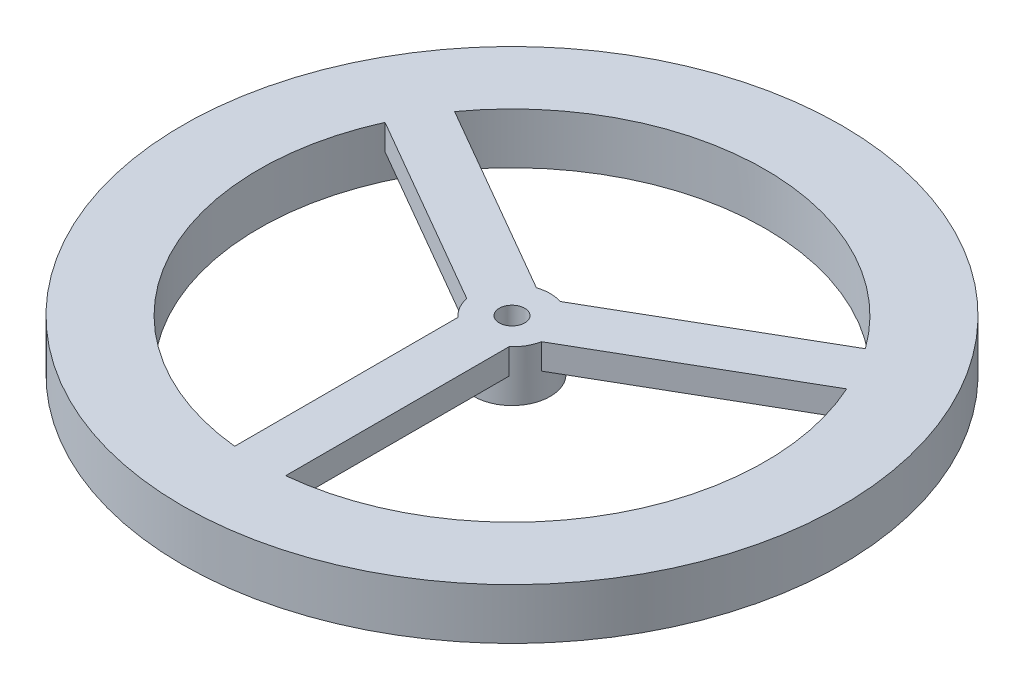
ISO-10303-21;
HEADER;
FILE_DESCRIPTION(('STEP AP214'),'2;1');
FILE_NAME('part.step','',(''),(''),'','','');
FILE_SCHEMA(('AUTOMOTIVE_DESIGN { 1 0 10303 214 1 1 1 1 }'));
ENDSEC;
DATA;
#1=APPLICATION_CONTEXT('core data for automotive mechanical design processes');
#2=APPLICATION_PROTOCOL_DEFINITION('international standard','automotive_design',2000,#1);
#3=PRODUCT_CONTEXT('',#1,'mechanical');
#4=PRODUCT('Part','Part','',(#3));
#5=PRODUCT_RELATED_PRODUCT_CATEGORY('part','',(#4));
#6=PRODUCT_DEFINITION_FORMATION('','',#4);
#7=PRODUCT_DEFINITION_CONTEXT('part definition',#1,'design');
#8=PRODUCT_DEFINITION('design','',#6,#7);
#9=PRODUCT_DEFINITION_SHAPE('','',#8);
#10=(LENGTH_UNIT() NAMED_UNIT(*) SI_UNIT(.MILLI.,.METRE.));
#11=(NAMED_UNIT(*) PLANE_ANGLE_UNIT() SI_UNIT($,.RADIAN.));
#12=(NAMED_UNIT(*) SI_UNIT($,.STERADIAN.) SOLID_ANGLE_UNIT());
#13=UNCERTAINTY_MEASURE_WITH_UNIT(LENGTH_MEASURE(1.E-05),#10,'distance_accuracy_value','');
#14=(GEOMETRIC_REPRESENTATION_CONTEXT(3) GLOBAL_UNCERTAINTY_ASSIGNED_CONTEXT((#13)) GLOBAL_UNIT_ASSIGNED_CONTEXT((#10,
#11,#12)) REPRESENTATION_CONTEXT('',''));
#15=CARTESIAN_POINT('',(0.,0.,0.));
#16=DIRECTION('',(0.,0.,1.));
#17=DIRECTION('',(1.,0.,0.));
#18=AXIS2_PLACEMENT_3D('',#15,#16,#17);
#19=CARTESIAN_POINT('',(0.,-10.,0.));
#20=DIRECTION('',(0.,1.,0.));
#21=DIRECTION('',(0.,0.,1.));
#22=AXIS2_PLACEMENT_3D('',#19,#20,#21);
#23=CYLINDRICAL_SURFACE('',#22,49.67);
#24=CARTESIAN_POINT('',(0.,0.,0.));
#25=DIRECTION('',(0.,1.,0.));
#26=DIRECTION('',(0.,0.,1.));
#27=AXIS2_PLACEMENT_3D('',#24,#25,#26);
#28=CIRCLE('',#27,49.67);
#29=CARTESIAN_POINT('',(4.99999999999999,0.,49.4176982466808));
#30=VERTEX_POINT('',#29);
#31=CARTESIAN_POINT('',(45.2969820781795,0.,-20.3787221044178));
#32=VERTEX_POINT('',#31);
#33=EDGE_CURVE('E263',#30,#32,#28,.T.);
#34=ORIENTED_EDGE('',*,*,#33,.T.);
#35=DIRECTION('',(0.,1.,0.));
#36=VECTOR('',#35,1.);
#37=CARTESIAN_POINT('',(45.2969820781795,-10.,-20.3787221044178));
#38=LINE('',#37,#36);
#39=CARTESIAN_POINT('',(45.2969820781795,-5.,-20.3787221044178));
#40=VERTEX_POINT('',#39);
#41=EDGE_CURVE('E164',#32,#40,#38,.F.);
#42=ORIENTED_EDGE('',*,*,#41,.T.);
#43=CARTESIAN_POINT('',(0.,-5.,0.));
#44=DIRECTION('',(0.,1.,0.));
#45=DIRECTION('',(0.,0.,1.));
#46=AXIS2_PLACEMENT_3D('',#43,#44,#45);
#47=CIRCLE('',#46,49.67);
#48=CARTESIAN_POINT('',(40.2969820781796,-5.,-29.0389761422622));
#49=VERTEX_POINT('',#48);
#50=EDGE_CURVE('E62',#49,#40,#47,.F.);
#51=ORIENTED_EDGE('',*,*,#50,.F.);
#52=DIRECTION('',(0.,1.,0.));
#53=VECTOR('',#52,1.);
#54=CARTESIAN_POINT('',(40.2969820781796,-10.,-29.0389761422622));
#55=LINE('',#54,#53);
#56=CARTESIAN_POINT('',(40.2969820781796,0.,-29.0389761422622));
#57=VERTEX_POINT('',#56);
#58=EDGE_CURVE('E145',#49,#57,#55,.T.);
#59=ORIENTED_EDGE('',*,*,#58,.T.);
#60=CARTESIAN_POINT('',(-40.2969820781792,0.,-29.0389761422628));
#61=VERTEX_POINT('',#60);
#62=EDGE_CURVE('E266',#57,#61,#28,.T.);
#63=ORIENTED_EDGE('',*,*,#62,.T.);
#64=DIRECTION('',(0.,1.,0.));
#65=VECTOR('',#64,1.);
#66=CARTESIAN_POINT('',(-40.2969820781792,-10.,-29.0389761422628));
#67=LINE('',#66,#65);
#68=CARTESIAN_POINT('',(-40.2969820781792,-5.,-29.0389761422628));
#69=VERTEX_POINT('',#68);
#70=EDGE_CURVE('E195',#61,#69,#67,.F.);
#71=ORIENTED_EDGE('',*,*,#70,.T.);
#72=CARTESIAN_POINT('',(0.,-5.,0.));
#73=DIRECTION('',(0.,1.,0.));
#74=DIRECTION('',(0.,0.,1.));
#75=AXIS2_PLACEMENT_3D('',#72,#73,#74);
#76=CIRCLE('',#75,49.67);
#77=CARTESIAN_POINT('',(-45.2969820781792,-5.,-20.3787221044184));
#78=VERTEX_POINT('',#77);
#79=EDGE_CURVE('E187',#78,#69,#76,.F.);
#80=ORIENTED_EDGE('',*,*,#79,.F.);
#81=DIRECTION('',(0.,1.,0.));
#82=VECTOR('',#81,1.);
#83=CARTESIAN_POINT('',(-45.2969820781792,-10.,-20.3787221044184));
#84=LINE('',#83,#82);
#85=CARTESIAN_POINT('',(-45.2969820781792,0.,-20.3787221044184));
#86=VERTEX_POINT('',#85);
#87=EDGE_CURVE('E192',#78,#86,#84,.T.);
#88=ORIENTED_EDGE('',*,*,#87,.T.);
#89=CARTESIAN_POINT('',(-4.99999999999999,0.,49.4176982466808));
#90=VERTEX_POINT('',#89);
#91=EDGE_CURVE('E252',#86,#90,#28,.T.);
#92=ORIENTED_EDGE('',*,*,#91,.T.);
#93=DIRECTION('',(0.,1.,0.));
#94=VECTOR('',#93,1.);
#95=CARTESIAN_POINT('',(-4.99999999999999,-10.,49.4176982466808));
#96=LINE('',#95,#94);
#97=CARTESIAN_POINT('',(-4.99999999999999,-5.,49.4176982466808));
#98=VERTEX_POINT('',#97);
#99=EDGE_CURVE('E248',#90,#98,#96,.F.);
#100=ORIENTED_EDGE('',*,*,#99,.T.);
#101=CARTESIAN_POINT('',(0.,-5.,0.));
#102=DIRECTION('',(0.,1.,0.));
#103=DIRECTION('',(0.,0.,1.));
#104=AXIS2_PLACEMENT_3D('',#101,#102,#103);
#105=CIRCLE('',#104,49.67);
#106=CARTESIAN_POINT('',(4.99999999999999,-5.,49.4176982466808));
#107=VERTEX_POINT('',#106);
#108=EDGE_CURVE('E262',#107,#98,#105,.F.);
#109=ORIENTED_EDGE('',*,*,#108,.F.);
#110=DIRECTION('',(0.,1.,0.));
#111=VECTOR('',#110,1.);
#112=CARTESIAN_POINT('',(4.99999999999999,-10.,49.4176982466808));
#113=LINE('',#112,#111);
#114=EDGE_CURVE('E241',#107,#30,#113,.T.);
#115=ORIENTED_EDGE('',*,*,#114,.T.);
#116=EDGE_LOOP('',(#34,#42,#51,#59,#63,#71,#80,#88,#92,#100,#109,#115));
#117=FACE_BOUND('',#116,.T.);
#118=CARTESIAN_POINT('',(0.,-10.,0.));
#119=DIRECTION('',(0.,1.,0.));
#120=DIRECTION('',(0.,0.,1.));
#121=AXIS2_PLACEMENT_3D('',#118,#119,#120);
#122=CIRCLE('',#121,49.67);
#123=CARTESIAN_POINT('',(0.,-10.,49.67));
#124=VERTEX_POINT('',#123);
#125=EDGE_CURVE('E253',#124,#124,#122,.T.);
#126=ORIENTED_EDGE('',*,*,#125,.F.);
#127=EDGE_LOOP('',(#126));
#128=FACE_BOUND('',#127,.T.);
#129=ADVANCED_FACE('F47',(#117,#128),#23,.F.);
#130=CARTESIAN_POINT('',(0.,-10.,0.));
#131=DIRECTION('',(0.,1.,0.));
#132=DIRECTION('',(0.,0.,1.));
#133=AXIS2_PLACEMENT_3D('',#130,#131,#132);
#134=CYLINDRICAL_SURFACE('',#133,64.67);
#135=CARTESIAN_POINT('',(0.,-10.,0.));
#136=DIRECTION('',(0.,1.,0.));
#137=DIRECTION('',(0.,0.,1.));
#138=AXIS2_PLACEMENT_3D('',#135,#136,#137);
#139=CIRCLE('',#138,64.67);
#140=CARTESIAN_POINT('',(0.,-10.,64.67));
#141=VERTEX_POINT('',#140);
#142=EDGE_CURVE('E257',#141,#141,#139,.T.);
#143=ORIENTED_EDGE('',*,*,#142,.T.);
#144=EDGE_LOOP('',(#143));
#145=FACE_BOUND('',#144,.T.);
#146=CARTESIAN_POINT('',(0.,0.,0.));
#147=DIRECTION('',(0.,1.,0.));
#148=DIRECTION('',(0.,0.,1.));
#149=AXIS2_PLACEMENT_3D('',#146,#147,#148);
#150=CIRCLE('',#149,64.67);
#151=CARTESIAN_POINT('',(0.,0.,64.67));
#152=VERTEX_POINT('',#151);
#153=EDGE_CURVE('E258',#152,#152,#150,.T.);
#154=ORIENTED_EDGE('',*,*,#153,.F.);
#155=EDGE_LOOP('',(#154));
#156=FACE_BOUND('',#155,.T.);
#157=ADVANCED_FACE('F325',(#145,#156),#134,.T.);
#158=CARTESIAN_POINT('',(0.,-10.,0.));
#159=DIRECTION('',(0.,1.,0.));
#160=DIRECTION('',(0.,0.,1.));
#161=AXIS2_PLACEMENT_3D('',#158,#159,#160);
#162=PLANE('',#161);
#163=ORIENTED_EDGE('',*,*,#125,.T.);
#164=EDGE_LOOP('',(#163));
#165=FACE_BOUND('',#164,.T.);
#166=ORIENTED_EDGE('',*,*,#142,.F.);
#167=EDGE_LOOP('',(#166));
#168=FACE_BOUND('',#167,.T.);
#169=ADVANCED_FACE('F319',(#165,#168),#162,.F.);
#170=CARTESIAN_POINT('',(0.,0.,0.));
#171=DIRECTION('',(0.,1.,0.));
#172=DIRECTION('',(0.,0.,1.));
#173=AXIS2_PLACEMENT_3D('',#170,#171,#172);
#174=PLANE('',#173);
#175=DIRECTION('',(0.866025403784443,0.,-0.499999999999992));
#176=VECTOR('',#175,1.);
#177=CARTESIAN_POINT('',(7.34122918275926,0.,1.53504204704753));
#178=LINE('',#177,#176);
#179=CARTESIAN_POINT('',(7.34122918275926,0.,1.53504204704753));
#180=VERTEX_POINT('',#179);
#181=EDGE_CURVE('E466',#180,#32,#178,.T.);
#182=ORIENTED_EDGE('',*,*,#181,.T.);
#183=ORIENTED_EDGE('',*,*,#33,.F.);
#184=DIRECTION('',(0.,0.,-1.));
#185=VECTOR('',#184,1.);
#186=CARTESIAN_POINT('',(5.,0.,5.59016994374947));
#187=LINE('',#186,#185);
#188=CARTESIAN_POINT('',(5.,0.,5.59016994374947));
#189=VERTEX_POINT('',#188);
#190=EDGE_CURVE('E226',#30,#189,#187,.T.);
#191=ORIENTED_EDGE('',*,*,#190,.T.);
#192=CARTESIAN_POINT('',(0.,0.,0.));
#193=DIRECTION('',(0.,1.,0.));
#194=DIRECTION('',(0.,0.,1.));
#195=AXIS2_PLACEMENT_3D('',#192,#193,#194);
#196=CIRCLE('',#195,7.5);
#197=EDGE_CURVE('E205',#189,#180,#196,.T.);
#198=ORIENTED_EDGE('',*,*,#197,.T.);
#199=EDGE_LOOP('',(#182,#183,#191,#198));
#200=FACE_BOUND('',#199,.T.);
#201=ORIENTED_EDGE('',*,*,#62,.F.);
#202=DIRECTION('',(-0.866025403784443,0.,0.499999999999992));
#203=VECTOR('',#202,1.);
#204=CARTESIAN_POINT('',(2.34122918275934,0.,-7.12521199079691));
#205=LINE('',#204,#203);
#206=CARTESIAN_POINT('',(2.34122918275934,0.,-7.12521199079691));
#207=VERTEX_POINT('',#206);
#208=EDGE_CURVE('E298',#57,#207,#205,.T.);
#209=ORIENTED_EDGE('',*,*,#208,.T.);
#210=CARTESIAN_POINT('',(-2.34122918275924,0.,-7.12521199079694));
#211=VERTEX_POINT('',#210);
#212=EDGE_CURVE('E152',#207,#211,#196,.T.);
#213=ORIENTED_EDGE('',*,*,#212,.T.);
#214=DIRECTION('',(-0.866025403784436,0.,-0.500000000000004));
#215=VECTOR('',#214,1.);
#216=CARTESIAN_POINT('',(-2.34122918275924,0.,-7.12521199079694));
#217=LINE('',#216,#215);
#218=EDGE_CURVE('E167',#211,#61,#217,.T.);
#219=ORIENTED_EDGE('',*,*,#218,.T.);
#220=EDGE_LOOP('',(#201,#209,#213,#219));
#221=FACE_BOUND('',#220,.T.);
#222=ORIENTED_EDGE('',*,*,#91,.F.);
#223=DIRECTION('',(0.866025403784436,0.,0.500000000000004));
#224=VECTOR('',#223,1.);
#225=CARTESIAN_POINT('',(-7.34122918275928,0.,1.53504204704742));
#226=LINE('',#225,#224);
#227=CARTESIAN_POINT('',(-7.34122918275928,0.,1.53504204704742));
#228=VERTEX_POINT('',#227);
#229=EDGE_CURVE('E173',#86,#228,#226,.T.);
#230=ORIENTED_EDGE('',*,*,#229,.T.);
#231=CARTESIAN_POINT('',(-5.,0.,5.59016994374947));
#232=VERTEX_POINT('',#231);
#233=EDGE_CURVE('E213',#228,#232,#196,.T.);
#234=ORIENTED_EDGE('',*,*,#233,.T.);
#235=DIRECTION('',(0.,0.,1.));
#236=VECTOR('',#235,1.);
#237=CARTESIAN_POINT('',(-5.,0.,5.59016994374947));
#238=LINE('',#237,#236);
#239=EDGE_CURVE('E220',#232,#90,#238,.T.);
#240=ORIENTED_EDGE('',*,*,#239,.T.);
#241=EDGE_LOOP('',(#222,#230,#234,#240));
#242=FACE_BOUND('',#241,.T.);
#243=ORIENTED_EDGE('',*,*,#153,.T.);
#244=EDGE_LOOP('',(#243));
#245=FACE_BOUND('',#244,.T.);
#246=CARTESIAN_POINT('',(0.,0.,0.));
#247=DIRECTION('',(0.,1.,0.));
#248=DIRECTION('',(0.,0.,1.));
#249=AXIS2_PLACEMENT_3D('',#246,#247,#248);
#250=CIRCLE('',#249,2.5);
#251=CARTESIAN_POINT('',(0.,0.,2.5));
#252=VERTEX_POINT('',#251);
#253=EDGE_CURVE('E199',#252,#252,#250,.T.);
#254=ORIENTED_EDGE('',*,*,#253,.F.);
#255=EDGE_LOOP('',(#254));
#256=FACE_BOUND('',#255,.T.);
#257=ADVANCED_FACE('F287',(#200,#221,#242,#245,#256),#174,.T.);
#258=CARTESIAN_POINT('',(0.,-5.,0.));
#259=DIRECTION('',(0.,1.,0.));
#260=DIRECTION('',(0.,0.,1.));
#261=AXIS2_PLACEMENT_3D('',#258,#259,#260);
#262=PLANE('',#261);
#263=DIRECTION('',(0.,0.,1.));
#264=VECTOR('',#263,1.);
#265=CARTESIAN_POINT('',(-5.,-5.,5.59016994374947));
#266=LINE('',#265,#264);
#267=CARTESIAN_POINT('',(-5.,-5.,5.59016994374947));
#268=VERTEX_POINT('',#267);
#269=EDGE_CURVE('E221',#268,#98,#266,.T.);
#270=ORIENTED_EDGE('',*,*,#269,.F.);
#271=CARTESIAN_POINT('',(0.,-5.,0.));
#272=DIRECTION('',(0.,1.,0.));
#273=DIRECTION('',(0.,0.,1.));
#274=AXIS2_PLACEMENT_3D('',#271,#272,#273);
#275=CIRCLE('',#274,7.5);
#276=CARTESIAN_POINT('',(5.,-5.,5.59016994374947));
#277=VERTEX_POINT('',#276);
#278=EDGE_CURVE('E209',#268,#277,#275,.T.);
#279=ORIENTED_EDGE('',*,*,#278,.T.);
#280=DIRECTION('',(0.,0.,-1.));
#281=VECTOR('',#280,1.);
#282=CARTESIAN_POINT('',(5.,-5.,5.59016994374947));
#283=LINE('',#282,#281);
#284=EDGE_CURVE('E225',#107,#277,#283,.T.);
#285=ORIENTED_EDGE('',*,*,#284,.F.);
#286=ORIENTED_EDGE('',*,*,#108,.T.);
#287=EDGE_LOOP('',(#270,#279,#285,#286));
#288=FACE_BOUND('',#287,.T.);
#289=ADVANCED_FACE('F311',(#288),#262,.F.);
#290=CARTESIAN_POINT('',(-5.,-5.,5.59016994374947));
#291=DIRECTION('',(-1.,0.,0.));
#292=DIRECTION('',(0.,0.,1.));
#293=AXIS2_PLACEMENT_3D('',#290,#291,#292);
#294=PLANE('',#293);
#295=ORIENTED_EDGE('',*,*,#99,.F.);
#296=ORIENTED_EDGE('',*,*,#239,.F.);
#297=DIRECTION('',(0.,1.,0.));
#298=VECTOR('',#297,1.);
#299=CARTESIAN_POINT('',(-5.,-5.,5.59016994374947));
#300=LINE('',#299,#298);
#301=EDGE_CURVE('E237',#268,#232,#300,.T.);
#302=ORIENTED_EDGE('',*,*,#301,.F.);
#303=ORIENTED_EDGE('',*,*,#269,.T.);
#304=EDGE_LOOP('',(#295,#296,#302,#303));
#305=FACE_BOUND('',#304,.T.);
#306=ADVANCED_FACE('F304',(#305),#294,.T.);
#307=CARTESIAN_POINT('',(5.,-5.,5.59016994374947));
#308=DIRECTION('',(1.,0.,0.));
#309=DIRECTION('',(0.,0.,-1.));
#310=AXIS2_PLACEMENT_3D('',#307,#308,#309);
#311=PLANE('',#310);
#312=ORIENTED_EDGE('',*,*,#114,.F.);
#313=ORIENTED_EDGE('',*,*,#284,.T.);
#314=DIRECTION('',(0.,1.,0.));
#315=VECTOR('',#314,1.);
#316=CARTESIAN_POINT('',(5.,-5.,5.59016994374947));
#317=LINE('',#316,#315);
#318=EDGE_CURVE('E230',#277,#189,#317,.T.);
#319=ORIENTED_EDGE('',*,*,#318,.T.);
#320=ORIENTED_EDGE('',*,*,#190,.F.);
#321=EDGE_LOOP('',(#312,#313,#319,#320));
#322=FACE_BOUND('',#321,.T.);
#323=ADVANCED_FACE('F310',(#322),#311,.T.);
#324=CARTESIAN_POINT('',(0.,-10.,0.));
#325=DIRECTION('',(0.,1.,0.));
#326=DIRECTION('',(0.,0.,1.));
#327=AXIS2_PLACEMENT_3D('',#324,#325,#326);
#328=CYLINDRICAL_SURFACE('',#327,2.5);
#329=CARTESIAN_POINT('',(0.,-10.,0.));
#330=DIRECTION('',(0.,1.,0.));
#331=DIRECTION('',(0.,0.,1.));
#332=AXIS2_PLACEMENT_3D('',#329,#330,#331);
#333=CIRCLE('',#332,2.5);
#334=CARTESIAN_POINT('',(0.,-10.,2.5));
#335=VERTEX_POINT('',#334);
#336=EDGE_CURVE('E200',#335,#335,#333,.T.);
#337=ORIENTED_EDGE('',*,*,#336,.F.);
#338=EDGE_LOOP('',(#337));
#339=FACE_BOUND('',#338,.T.);
#340=ORIENTED_EDGE('',*,*,#253,.T.);
#341=EDGE_LOOP('',(#340));
#342=FACE_BOUND('',#341,.T.);
#343=ADVANCED_FACE('F337',(#339,#342),#328,.F.);
#344=CARTESIAN_POINT('',(0.,-10.,0.));
#345=DIRECTION('',(0.,1.,0.));
#346=DIRECTION('',(0.,0.,1.));
#347=AXIS2_PLACEMENT_3D('',#344,#345,#346);
#348=CYLINDRICAL_SURFACE('',#347,7.5);
#349=DIRECTION('',(0.,1.,0.));
#350=VECTOR('',#349,1.);
#351=CARTESIAN_POINT('',(7.34122918275926,-5.,1.53504204704753));
#352=LINE('',#351,#350);
#353=CARTESIAN_POINT('',(7.34122918275926,-5.,1.53504204704753));
#354=VERTEX_POINT('',#353);
#355=EDGE_CURVE('E154',#354,#180,#352,.T.);
#356=ORIENTED_EDGE('',*,*,#355,.T.);
#357=ORIENTED_EDGE('',*,*,#197,.F.);
#358=ORIENTED_EDGE('',*,*,#318,.F.);
#359=ORIENTED_EDGE('',*,*,#278,.F.);
#360=ORIENTED_EDGE('',*,*,#301,.T.);
#361=ORIENTED_EDGE('',*,*,#233,.F.);
#362=DIRECTION('',(0.,1.,0.));
#363=VECTOR('',#362,1.);
#364=CARTESIAN_POINT('',(-7.34122918275928,-5.,1.53504204704742));
#365=LINE('',#364,#363);
#366=CARTESIAN_POINT('',(-7.34122918275928,-5.,1.53504204704742));
#367=VERTEX_POINT('',#366);
#368=EDGE_CURVE('E177',#367,#228,#365,.T.);
#369=ORIENTED_EDGE('',*,*,#368,.F.);
#370=CARTESIAN_POINT('',(0.,-5.,0.));
#371=DIRECTION('',(0.,1.,0.));
#372=DIRECTION('',(0.,0.,1.));
#373=AXIS2_PLACEMENT_3D('',#370,#371,#372);
#374=CIRCLE('',#373,7.5);
#375=CARTESIAN_POINT('',(-2.34122918275924,-5.,-7.12521199079694));
#376=VERTEX_POINT('',#375);
#377=EDGE_CURVE('E55',#367,#376,#374,.F.);
#378=ORIENTED_EDGE('',*,*,#377,.T.);
#379=DIRECTION('',(0.,1.,0.));
#380=VECTOR('',#379,1.);
#381=CARTESIAN_POINT('',(-2.34122918275924,-5.,-7.12521199079694));
#382=LINE('',#381,#380);
#383=EDGE_CURVE('E184',#376,#211,#382,.T.);
#384=ORIENTED_EDGE('',*,*,#383,.T.);
#385=ORIENTED_EDGE('',*,*,#212,.F.);
#386=DIRECTION('',(0.,1.,0.));
#387=VECTOR('',#386,1.);
#388=CARTESIAN_POINT('',(2.34122918275934,-5.,-7.12521199079691));
#389=LINE('',#388,#387);
#390=CARTESIAN_POINT('',(2.34122918275934,-5.,-7.12521199079691));
#391=VERTEX_POINT('',#390);
#392=EDGE_CURVE('E143',#391,#207,#389,.T.);
#393=ORIENTED_EDGE('',*,*,#392,.F.);
#394=CARTESIAN_POINT('',(0.,-5.,0.));
#395=DIRECTION('',(0.,1.,0.));
#396=DIRECTION('',(0.,0.,1.));
#397=AXIS2_PLACEMENT_3D('',#394,#395,#396);
#398=CIRCLE('',#397,7.5);
#399=EDGE_CURVE('E12',#391,#354,#398,.F.);
#400=ORIENTED_EDGE('',*,*,#399,.T.);
#401=EDGE_LOOP('',(#356,#357,#358,#359,#360,#361,#369,#378,#384,#385,#393,#400));
#402=FACE_BOUND('',#401,.T.);
#403=CARTESIAN_POINT('',(0.,-10.,0.));
#404=DIRECTION('',(0.,1.,0.));
#405=DIRECTION('',(0.,0.,1.));
#406=AXIS2_PLACEMENT_3D('',#403,#404,#405);
#407=CIRCLE('',#406,7.5);
#408=CARTESIAN_POINT('',(0.,-10.,7.5));
#409=VERTEX_POINT('',#408);
#410=EDGE_CURVE('E204',#409,#409,#407,.T.);
#411=ORIENTED_EDGE('',*,*,#410,.T.);
#412=EDGE_LOOP('',(#411));
#413=FACE_BOUND('',#412,.T.);
#414=ADVANCED_FACE('F149',(#402,#413),#348,.T.);
#415=CARTESIAN_POINT('',(0.,-10.,0.));
#416=DIRECTION('',(0.,1.,0.));
#417=DIRECTION('',(0.,0.,1.));
#418=AXIS2_PLACEMENT_3D('',#415,#416,#417);
#419=PLANE('',#418);
#420=ORIENTED_EDGE('',*,*,#336,.T.);
#421=EDGE_LOOP('',(#420));
#422=FACE_BOUND('',#421,.T.);
#423=ORIENTED_EDGE('',*,*,#410,.F.);
#424=EDGE_LOOP('',(#423));
#425=FACE_BOUND('',#424,.T.);
#426=ADVANCED_FACE('F345',(#422,#425),#419,.F.);
#427=CARTESIAN_POINT('',(-2.34122918275924,-5.,-7.12521199079694));
#428=DIRECTION('',(0.500000000000004,0.,-0.866025403784436));
#429=DIRECTION('',(-0.866025403784436,0.,-0.500000000000004));
#430=AXIS2_PLACEMENT_3D('',#427,#428,#429);
#431=PLANE('',#430);
#432=ORIENTED_EDGE('',*,*,#70,.F.);
#433=ORIENTED_EDGE('',*,*,#218,.F.);
#434=ORIENTED_EDGE('',*,*,#383,.F.);
#435=DIRECTION('',(-0.866025403784436,0.,-0.500000000000004));
#436=VECTOR('',#435,1.);
#437=CARTESIAN_POINT('',(-2.34122918275924,-5.,-7.12521199079694));
#438=LINE('',#437,#436);
#439=EDGE_CURVE('E168',#376,#69,#438,.T.);
#440=ORIENTED_EDGE('',*,*,#439,.T.);
#441=EDGE_LOOP('',(#432,#433,#434,#440));
#442=FACE_BOUND('',#441,.T.);
#443=ADVANCED_FACE('F297',(#442),#431,.T.);
#444=CARTESIAN_POINT('',(-7.34122918275928,-5.,1.53504204704742));
#445=DIRECTION('',(-0.500000000000004,0.,0.866025403784436));
#446=DIRECTION('',(0.866025403784436,0.,0.500000000000004));
#447=AXIS2_PLACEMENT_3D('',#444,#445,#446);
#448=PLANE('',#447);
#449=ORIENTED_EDGE('',*,*,#87,.F.);
#450=DIRECTION('',(0.866025403784436,0.,0.500000000000004));
#451=VECTOR('',#450,1.);
#452=CARTESIAN_POINT('',(-7.34122918275928,-5.,1.53504204704742));
#453=LINE('',#452,#451);
#454=EDGE_CURVE('E172',#78,#367,#453,.T.);
#455=ORIENTED_EDGE('',*,*,#454,.T.);
#456=ORIENTED_EDGE('',*,*,#368,.T.);
#457=ORIENTED_EDGE('',*,*,#229,.F.);
#458=EDGE_LOOP('',(#449,#455,#456,#457));
#459=FACE_BOUND('',#458,.T.);
#460=ADVANCED_FACE('F281',(#459),#448,.T.);
#461=CARTESIAN_POINT('',(0.,-5.,0.));
#462=DIRECTION('',(0.,1.,0.));
#463=DIRECTION('',(-0.866025403784436,0.,-0.500000000000004));
#464=AXIS2_PLACEMENT_3D('',#461,#462,#463);
#465=PLANE('',#464);
#466=ORIENTED_EDGE('',*,*,#454,.F.);
#467=ORIENTED_EDGE('',*,*,#79,.T.);
#468=ORIENTED_EDGE('',*,*,#439,.F.);
#469=ORIENTED_EDGE('',*,*,#377,.F.);
#470=EDGE_LOOP('',(#466,#467,#468,#469));
#471=FACE_BOUND('',#470,.T.);
#472=ADVANCED_FACE('F278',(#471),#465,.F.);
#473=CARTESIAN_POINT('',(7.34122918275926,-5.,1.53504204704753));
#474=DIRECTION('',(0.499999999999992,0.,0.866025403784443));
#475=DIRECTION('',(0.866025403784443,0.,-0.499999999999992));
#476=AXIS2_PLACEMENT_3D('',#473,#474,#475);
#477=PLANE('',#476);
#478=ORIENTED_EDGE('',*,*,#41,.F.);
#479=ORIENTED_EDGE('',*,*,#181,.F.);
#480=ORIENTED_EDGE('',*,*,#355,.F.);
#481=DIRECTION('',(0.866025403784443,0.,-0.499999999999992));
#482=VECTOR('',#481,1.);
#483=CARTESIAN_POINT('',(7.34122918275926,-5.,1.53504204704753));
#484=LINE('',#483,#482);
#485=EDGE_CURVE('E136',#354,#40,#484,.T.);
#486=ORIENTED_EDGE('',*,*,#485,.T.);
#487=EDGE_LOOP('',(#478,#479,#480,#486));
#488=FACE_BOUND('',#487,.T.);
#489=ADVANCED_FACE('F359',(#488),#477,.T.);
#490=CARTESIAN_POINT('',(2.34122918275934,-5.,-7.12521199079691));
#491=DIRECTION('',(-0.499999999999992,0.,-0.866025403784443));
#492=DIRECTION('',(-0.866025403784443,0.,0.499999999999992));
#493=AXIS2_PLACEMENT_3D('',#490,#491,#492);
#494=PLANE('',#493);
#495=ORIENTED_EDGE('',*,*,#58,.F.);
#496=DIRECTION('',(-0.866025403784443,0.,0.499999999999992));
#497=VECTOR('',#496,1.);
#498=CARTESIAN_POINT('',(2.34122918275934,-5.,-7.12521199079691));
#499=LINE('',#498,#497);
#500=EDGE_CURVE('E134',#49,#391,#499,.T.);
#501=ORIENTED_EDGE('',*,*,#500,.T.);
#502=ORIENTED_EDGE('',*,*,#392,.T.);
#503=ORIENTED_EDGE('',*,*,#208,.F.);
#504=EDGE_LOOP('',(#495,#501,#502,#503));
#505=FACE_BOUND('',#504,.T.);
#506=ADVANCED_FACE('F141',(#505),#494,.T.);
#507=CARTESIAN_POINT('',(0.,-5.,0.));
#508=DIRECTION('',(0.,1.,0.));
#509=DIRECTION('',(0.866025403784443,0.,-0.499999999999992));
#510=AXIS2_PLACEMENT_3D('',#507,#508,#509);
#511=PLANE('',#510);
#512=ORIENTED_EDGE('',*,*,#500,.F.);
#513=ORIENTED_EDGE('',*,*,#50,.T.);
#514=ORIENTED_EDGE('',*,*,#485,.F.);
#515=ORIENTED_EDGE('',*,*,#399,.F.);
#516=EDGE_LOOP('',(#512,#513,#514,#515));
#517=FACE_BOUND('',#516,.T.);
#518=ADVANCED_FACE('F133',(#517),#511,.F.);
#519=CLOSED_SHELL('',(#129,#157,#169,#257,#289,#306,#323,#343,#414,#426,#443,#460,#472,#489,
#506,#518));
#520=MANIFOLD_SOLID_BREP('B2',#519);
#521=ADVANCED_BREP_SHAPE_REPRESENTATION('',(#18,#520),#14);
#522=SHAPE_DEFINITION_REPRESENTATION(#9,#521);
ENDSEC;
END-ISO-10303-21;
